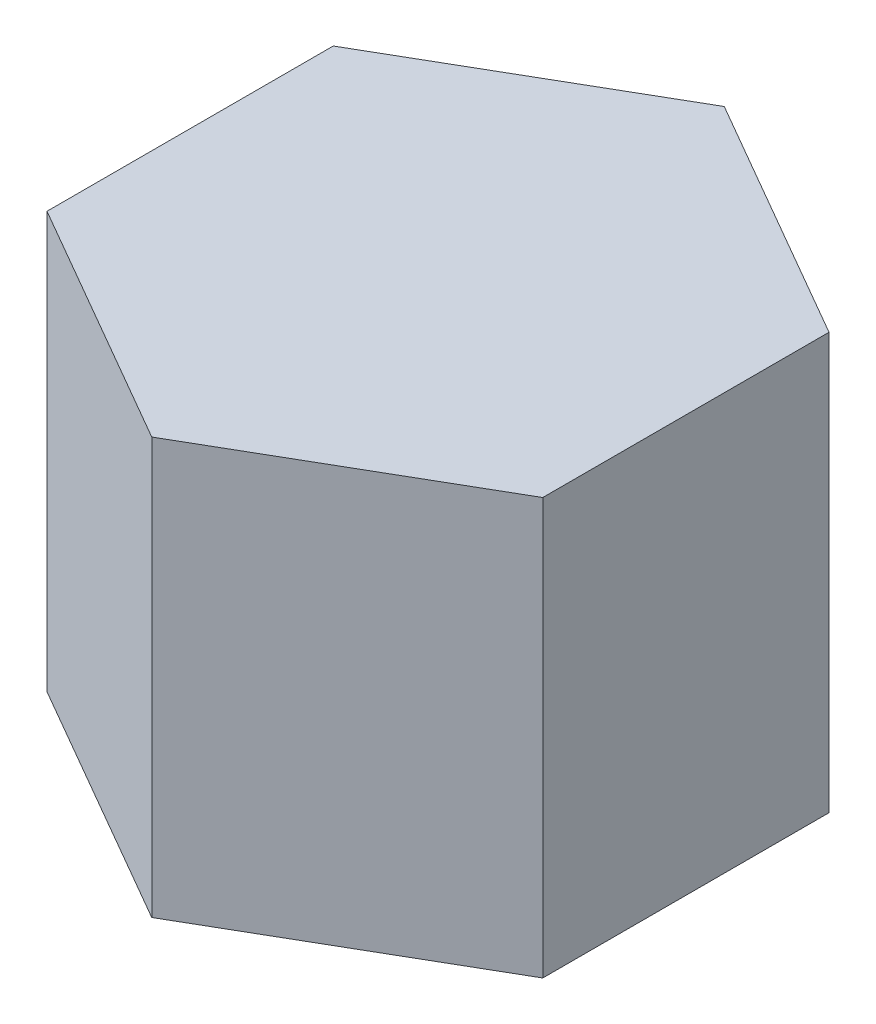
ISO-10303-21;
HEADER;
FILE_DESCRIPTION(('STEP AP214'),'2;1');
FILE_NAME('part.step','',(''),(''),'','','');
FILE_SCHEMA(('AUTOMOTIVE_DESIGN { 1 0 10303 214 1 1 1 1 }'));
ENDSEC;
DATA;
#1=APPLICATION_CONTEXT('core data for automotive mechanical design processes');
#2=APPLICATION_PROTOCOL_DEFINITION('international standard','automotive_design',2000,#1);
#3=PRODUCT_CONTEXT('',#1,'mechanical');
#4=PRODUCT('Part','Part','',(#3));
#5=PRODUCT_RELATED_PRODUCT_CATEGORY('part','',(#4));
#6=PRODUCT_DEFINITION_FORMATION('','',#4);
#7=PRODUCT_DEFINITION_CONTEXT('part definition',#1,'design');
#8=PRODUCT_DEFINITION('design','',#6,#7);
#9=PRODUCT_DEFINITION_SHAPE('','',#8);
#10=(LENGTH_UNIT() NAMED_UNIT(*) SI_UNIT(.MILLI.,.METRE.));
#11=(NAMED_UNIT(*) PLANE_ANGLE_UNIT() SI_UNIT($,.RADIAN.));
#12=(NAMED_UNIT(*) SI_UNIT($,.STERADIAN.) SOLID_ANGLE_UNIT());
#13=UNCERTAINTY_MEASURE_WITH_UNIT(LENGTH_MEASURE(1.E-05),#10,'distance_accuracy_value','');
#14=(GEOMETRIC_REPRESENTATION_CONTEXT(3) GLOBAL_UNCERTAINTY_ASSIGNED_CONTEXT((#13)) GLOBAL_UNIT_ASSIGNED_CONTEXT((#10,
#11,#12)) REPRESENTATION_CONTEXT('',''));
#15=CARTESIAN_POINT('',(0.,0.,0.));
#16=DIRECTION('',(0.,0.,1.));
#17=DIRECTION('',(1.,0.,0.));
#18=AXIS2_PLACEMENT_3D('',#15,#16,#17);
#19=CARTESIAN_POINT('',(210.339551417382,-147.556598747966,293.414022028063));
#20=DIRECTION('',(-0.500000000000028,0.,-0.866025403784422));
#21=DIRECTION('',(-0.866025403784423,0.,0.500000000000028));
#22=AXIS2_PLACEMENT_3D('',#19,#20,#21);
#23=PLANE('',#22);
#24=CARTESIAN_POINT('',(210.642660308706,-147.047793579175,293.239022028063));
#25=DIRECTION('',(-0.866025403784422,0.,0.500000000000028));
#26=VECTOR('',#25,1.);
#27=LINE('',#24,#26);
#28=CARTESIAN_POINT('',(210.642660308706,-147.047793579175,293.239022028063));
#29=VERTEX_POINT('',#28);
#30=CARTESIAN_POINT('',(210.339551417382,-147.047793579175,293.414022028063));
#31=VERTEX_POINT('',#30);
#32=EDGE_CURVE('E170',#29,#31,#27,.T.);
#33=ORIENTED_EDGE('',*,*,#32,.T.);
#34=CARTESIAN_POINT('',(210.339551417382,-147.556598747966,293.414022028063));
#35=DIRECTION('',(0.,1.,0.));
#36=VECTOR('',#35,1.);
#37=LINE('',#34,#36);
#38=CARTESIAN_POINT('',(210.339551417382,-147.556598747966,293.414022028063));
#39=VERTEX_POINT('',#38);
#40=EDGE_CURVE('E35',#39,#31,#37,.T.);
#41=ORIENTED_EDGE('',*,*,#40,.F.);
#42=CARTESIAN_POINT('',(210.642660308706,-147.556598747966,293.239022028063));
#43=DIRECTION('',(-0.866025403784422,0.,0.500000000000028));
#44=VECTOR('',#43,1.);
#45=LINE('',#42,#44);
#46=CARTESIAN_POINT('',(210.642660308706,-147.556598747966,293.239022028063));
#47=VERTEX_POINT('',#46);
#48=EDGE_CURVE('E159',#47,#39,#45,.T.);
#49=ORIENTED_EDGE('',*,*,#48,.F.);
#50=CARTESIAN_POINT('',(210.642660308706,-147.556598747966,293.239022028063));
#51=DIRECTION('',(0.,1.,0.));
#52=VECTOR('',#51,1.);
#53=LINE('',#50,#52);
#54=EDGE_CURVE('E10',#47,#29,#53,.T.);
#55=ORIENTED_EDGE('',*,*,#54,.T.);
#56=EDGE_LOOP('',(#33,#41,#49,#55));
#57=FACE_BOUND('',#56,.T.);
#58=ADVANCED_FACE('F16',(#57),#23,.F.);
#59=CARTESIAN_POINT('',(210.642660308706,-147.556598747966,291.594471220494));
#60=DIRECTION('',(-1.,0.,0.));
#61=DIRECTION('',(0.,-1.,0.));
#62=AXIS2_PLACEMENT_3D('',#59,#60,#61);
#63=PLANE('',#62);
#64=CARTESIAN_POINT('',(210.642660308706,-147.047793579175,292.889022028063));
#65=DIRECTION('',(0.,0.,1.));
#66=VECTOR('',#65,1.);
#67=LINE('',#64,#66);
#68=CARTESIAN_POINT('',(210.642660308706,-147.047793579175,292.889022028063));
#69=VERTEX_POINT('',#68);
#70=EDGE_CURVE('E167',#69,#29,#67,.T.);
#71=ORIENTED_EDGE('',*,*,#70,.T.);
#72=ORIENTED_EDGE('',*,*,#54,.F.);
#73=CARTESIAN_POINT('',(210.642660308706,-147.556598747966,292.889022028063));
#74=DIRECTION('',(0.,0.,1.));
#75=VECTOR('',#74,1.);
#76=LINE('',#73,#75);
#77=CARTESIAN_POINT('',(210.642660308706,-147.556598747966,292.889022028063));
#78=VERTEX_POINT('',#77);
#79=EDGE_CURVE('E156',#78,#47,#76,.T.);
#80=ORIENTED_EDGE('',*,*,#79,.F.);
#81=CARTESIAN_POINT('',(210.642660308706,-147.556598747966,292.889022028063));
#82=DIRECTION('',(0.,1.,0.));
#83=VECTOR('',#82,1.);
#84=LINE('',#81,#83);
#85=EDGE_CURVE('E27',#78,#69,#84,.T.);
#86=ORIENTED_EDGE('',*,*,#85,.T.);
#87=EDGE_LOOP('',(#71,#72,#80,#86));
#88=FACE_BOUND('',#87,.T.);
#89=ADVANCED_FACE('F189',(#88),#63,.F.);
#90=CARTESIAN_POINT('',(210.642660308706,-147.556598747966,292.889022028063));
#91=DIRECTION('',(-0.499999999999943,0.,0.866025403784471));
#92=DIRECTION('',(0.866025403784471,0.,0.499999999999943));
#93=AXIS2_PLACEMENT_3D('',#90,#91,#92);
#94=PLANE('',#93);
#95=CARTESIAN_POINT('',(210.339551417382,-147.047793579175,292.714022028063));
#96=DIRECTION('',(0.866025403784471,0.,0.499999999999943));
#97=VECTOR('',#96,1.);
#98=LINE('',#95,#97);
#99=CARTESIAN_POINT('',(210.339551417382,-147.047793579175,292.714022028063));
#100=VERTEX_POINT('',#99);
#101=EDGE_CURVE('E163',#100,#69,#98,.T.);
#102=ORIENTED_EDGE('',*,*,#101,.T.);
#103=ORIENTED_EDGE('',*,*,#85,.F.);
#104=CARTESIAN_POINT('',(210.339551417382,-147.556598747966,292.714022028063));
#105=DIRECTION('',(0.866025403784471,0.,0.499999999999943));
#106=VECTOR('',#105,1.);
#107=LINE('',#104,#106);
#108=CARTESIAN_POINT('',(210.339551417382,-147.556598747966,292.714022028063));
#109=VERTEX_POINT('',#108);
#110=EDGE_CURVE('E106',#109,#78,#107,.T.);
#111=ORIENTED_EDGE('',*,*,#110,.F.);
#112=CARTESIAN_POINT('',(210.339551417382,-147.556598747966,292.714022028063));
#113=DIRECTION('',(0.,1.,0.));
#114=VECTOR('',#113,1.);
#115=LINE('',#112,#114);
#116=EDGE_CURVE('E94',#109,#100,#115,.T.);
#117=ORIENTED_EDGE('',*,*,#116,.T.);
#118=EDGE_LOOP('',(#102,#103,#111,#117));
#119=FACE_BOUND('',#118,.T.);
#120=ADVANCED_FACE('F198',(#119),#94,.F.);
#121=CARTESIAN_POINT('',(210.339551417382,-147.556598747966,292.714022028063));
#122=DIRECTION('',(0.499999999999978,0.,0.866025403784452));
#123=DIRECTION('',(0.866025403784452,0.,-0.499999999999978));
#124=AXIS2_PLACEMENT_3D('',#121,#122,#123);
#125=PLANE('',#124);
#126=CARTESIAN_POINT('',(210.036442526057,-147.047793579175,292.889022028063));
#127=DIRECTION('',(0.866025403784452,0.,-0.499999999999978));
#128=VECTOR('',#127,1.);
#129=LINE('',#126,#128);
#130=CARTESIAN_POINT('',(210.036442526057,-147.047793579175,292.889022028063));
#131=VERTEX_POINT('',#130);
#132=EDGE_CURVE('E162',#131,#100,#129,.T.);
#133=ORIENTED_EDGE('',*,*,#132,.T.);
#134=ORIENTED_EDGE('',*,*,#116,.F.);
#135=CARTESIAN_POINT('',(210.036442526057,-147.556598747966,292.889022028063));
#136=DIRECTION('',(0.866025403784452,0.,-0.499999999999978));
#137=VECTOR('',#136,1.);
#138=LINE('',#135,#137);
#139=CARTESIAN_POINT('',(210.036442526057,-147.556598747966,292.889022028063));
#140=VERTEX_POINT('',#139);
#141=EDGE_CURVE('E98',#140,#109,#138,.T.);
#142=ORIENTED_EDGE('',*,*,#141,.F.);
#143=CARTESIAN_POINT('',(210.036442526057,-147.556598747966,292.889022028063));
#144=DIRECTION('',(0.,1.,0.));
#145=VECTOR('',#144,1.);
#146=LINE('',#143,#145);
#147=EDGE_CURVE('E79',#140,#131,#146,.T.);
#148=ORIENTED_EDGE('',*,*,#147,.T.);
#149=EDGE_LOOP('',(#133,#134,#142,#148));
#150=FACE_BOUND('',#149,.T.);
#151=ADVANCED_FACE('F100',(#150),#125,.F.);
#152=CARTESIAN_POINT('',(210.036442526057,-147.556598747966,291.594471220494));
#153=DIRECTION('',(1.,0.,0.));
#154=DIRECTION('',(0.,1.,0.));
#155=AXIS2_PLACEMENT_3D('',#152,#153,#154);
#156=PLANE('',#155);
#157=CARTESIAN_POINT('',(210.036442526057,-147.047793579175,293.239022028063));
#158=DIRECTION('',(0.,0.,-1.));
#159=VECTOR('',#158,1.);
#160=LINE('',#157,#159);
#161=CARTESIAN_POINT('',(210.036442526057,-147.047793579175,293.239022028063));
#162=VERTEX_POINT('',#161);
#163=EDGE_CURVE('E88',#162,#131,#160,.T.);
#164=ORIENTED_EDGE('',*,*,#163,.T.);
#165=ORIENTED_EDGE('',*,*,#147,.F.);
#166=CARTESIAN_POINT('',(210.036442526057,-147.556598747966,293.239022028063));
#167=DIRECTION('',(0.,0.,-1.));
#168=VECTOR('',#167,1.);
#169=LINE('',#166,#168);
#170=CARTESIAN_POINT('',(210.036442526057,-147.556598747966,293.239022028063));
#171=VERTEX_POINT('',#170);
#172=EDGE_CURVE('E84',#171,#140,#169,.T.);
#173=ORIENTED_EDGE('',*,*,#172,.F.);
#174=CARTESIAN_POINT('',(210.036442526057,-147.556598747966,293.239022028063));
#175=DIRECTION('',(0.,1.,0.));
#176=VECTOR('',#175,1.);
#177=LINE('',#174,#176);
#178=EDGE_CURVE('E58',#171,#162,#177,.T.);
#179=ORIENTED_EDGE('',*,*,#178,.T.);
#180=EDGE_LOOP('',(#164,#165,#173,#179));
#181=FACE_BOUND('',#180,.T.);
#182=ADVANCED_FACE('F82',(#181),#156,.F.);
#183=CARTESIAN_POINT('',(210.036442526057,-147.556598747966,293.239022028063));
#184=DIRECTION('',(0.500000000000096,0.,-0.866025403784383));
#185=DIRECTION('',(-0.866025403784383,0.,-0.500000000000096));
#186=AXIS2_PLACEMENT_3D('',#183,#184,#185);
#187=PLANE('',#186);
#188=CARTESIAN_POINT('',(210.339551417382,-147.047793579175,293.414022028063));
#189=DIRECTION('',(-0.866025403784383,0.,-0.500000000000096));
#190=VECTOR('',#189,1.);
#191=LINE('',#188,#190);
#192=EDGE_CURVE('E160',#31,#162,#191,.T.);
#193=ORIENTED_EDGE('',*,*,#192,.T.);
#194=ORIENTED_EDGE('',*,*,#178,.F.);
#195=CARTESIAN_POINT('',(210.339551417382,-147.556598747966,293.414022028063));
#196=DIRECTION('',(-0.866025403784383,0.,-0.500000000000096));
#197=VECTOR('',#196,1.);
#198=LINE('',#195,#197);
#199=EDGE_CURVE('E112',#39,#171,#198,.T.);
#200=ORIENTED_EDGE('',*,*,#199,.F.);
#201=ORIENTED_EDGE('',*,*,#40,.T.);
#202=EDGE_LOOP('',(#193,#194,#200,#201));
#203=FACE_BOUND('',#202,.T.);
#204=ADVANCED_FACE('F131',(#203),#187,.F.);
#205=CARTESIAN_POINT('',(206.491105863044,-147.556598747966,291.594471220494));
#206=DIRECTION('',(0.,1.,0.));
#207=DIRECTION('',(-1.,0.,0.));
#208=AXIS2_PLACEMENT_3D('',#205,#206,#207);
#209=PLANE('',#208);
#210=ORIENTED_EDGE('',*,*,#48,.T.);
#211=ORIENTED_EDGE('',*,*,#199,.T.);
#212=ORIENTED_EDGE('',*,*,#172,.T.);
#213=ORIENTED_EDGE('',*,*,#141,.T.);
#214=ORIENTED_EDGE('',*,*,#110,.T.);
#215=ORIENTED_EDGE('',*,*,#79,.T.);
#216=EDGE_LOOP('',(#210,#211,#212,#213,#214,#215));
#217=FACE_BOUND('',#216,.T.);
#218=ADVANCED_FACE('F111',(#217),#209,.F.);
#219=CARTESIAN_POINT('',(206.491105863044,-147.047793579175,291.594471220494));
#220=DIRECTION('',(0.,1.,0.));
#221=DIRECTION('',(-1.,0.,0.));
#222=AXIS2_PLACEMENT_3D('',#219,#220,#221);
#223=PLANE('',#222);
#224=ORIENTED_EDGE('',*,*,#32,.F.);
#225=ORIENTED_EDGE('',*,*,#70,.F.);
#226=ORIENTED_EDGE('',*,*,#101,.F.);
#227=ORIENTED_EDGE('',*,*,#132,.F.);
#228=ORIENTED_EDGE('',*,*,#163,.F.);
#229=ORIENTED_EDGE('',*,*,#192,.F.);
#230=EDGE_LOOP('',(#224,#225,#226,#227,#228,#229));
#231=FACE_BOUND('',#230,.T.);
#232=ADVANCED_FACE('F130',(#231),#223,.T.);
#233=CLOSED_SHELL('',(#58,#89,#120,#151,#182,#204,#218,#232));
#234=MANIFOLD_SOLID_BREP('B1',#233);
#235=ADVANCED_BREP_SHAPE_REPRESENTATION('',(#18,#234),#14);
#236=SHAPE_DEFINITION_REPRESENTATION(#9,#235);
ENDSEC;
END-ISO-10303-21;
